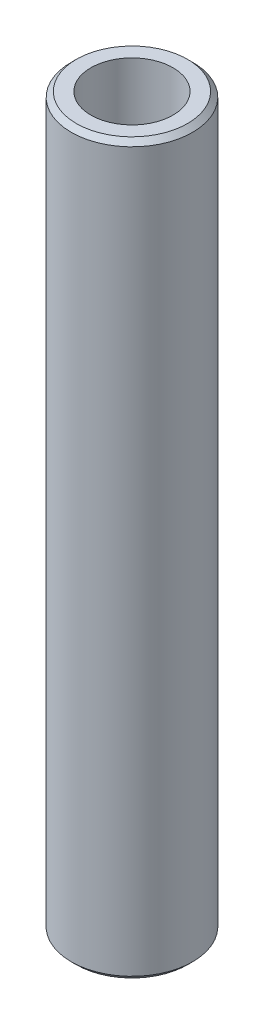
ISO-10303-21;
HEADER;
FILE_DESCRIPTION(('STEP AP214'),'2;1');
FILE_NAME('part.step','',(''),(''),'','','');
FILE_SCHEMA(('AUTOMOTIVE_DESIGN { 1 0 10303 214 1 1 1 1 }'));
ENDSEC;
DATA;
#1=APPLICATION_CONTEXT('core data for automotive mechanical design processes');
#2=APPLICATION_PROTOCOL_DEFINITION('international standard','automotive_design',2000,#1);
#3=PRODUCT_CONTEXT('',#1,'mechanical');
#4=PRODUCT('Part','Part','',(#3));
#5=PRODUCT_RELATED_PRODUCT_CATEGORY('part','',(#4));
#6=PRODUCT_DEFINITION_FORMATION('','',#4);
#7=PRODUCT_DEFINITION_CONTEXT('part definition',#1,'design');
#8=PRODUCT_DEFINITION('design','',#6,#7);
#9=PRODUCT_DEFINITION_SHAPE('','',#8);
#10=(LENGTH_UNIT() NAMED_UNIT(*) SI_UNIT(.MILLI.,.METRE.));
#11=(NAMED_UNIT(*) PLANE_ANGLE_UNIT() SI_UNIT($,.RADIAN.));
#12=(NAMED_UNIT(*) SI_UNIT($,.STERADIAN.) SOLID_ANGLE_UNIT());
#13=UNCERTAINTY_MEASURE_WITH_UNIT(LENGTH_MEASURE(1.E-05),#10,'distance_accuracy_value','');
#14=(GEOMETRIC_REPRESENTATION_CONTEXT(3) GLOBAL_UNCERTAINTY_ASSIGNED_CONTEXT((#13)) GLOBAL_UNIT_ASSIGNED_CONTEXT((#10,
#11,#12)) REPRESENTATION_CONTEXT('',''));
#15=CARTESIAN_POINT('',(0.,0.,0.));
#16=DIRECTION('',(0.,0.,1.));
#17=DIRECTION('',(1.,0.,0.));
#18=AXIS2_PLACEMENT_3D('',#15,#16,#17);
#19=CARTESIAN_POINT('',(0.,600.,0.));
#20=DIRECTION('',(0.,-1.,0.));
#21=DIRECTION('',(0.,0.,-1.));
#22=AXIS2_PLACEMENT_3D('',#19,#20,#21);
#23=CYLINDRICAL_SURFACE('',#22,50.);
#24=CARTESIAN_POINT('',(0.,595.824829830762,0.));
#25=DIRECTION('',(0.,1.,0.));
#26=DIRECTION('',(0.,0.,1.));
#27=AXIS2_PLACEMENT_3D('',#24,#25,#26);
#28=CIRCLE('',#27,50.);
#29=CARTESIAN_POINT('',(0.,595.824829830762,50.));
#30=VERTEX_POINT('',#29);
#31=EDGE_CURVE('E50',#30,#30,#28,.F.);
#32=ORIENTED_EDGE('',*,*,#31,.T.);
#33=EDGE_LOOP('',(#32));
#34=FACE_BOUND('',#33,.T.);
#35=CARTESIAN_POINT('',(0.,4.17517016923774,0.));
#36=DIRECTION('',(0.,1.,0.));
#37=DIRECTION('',(0.,0.,1.));
#38=AXIS2_PLACEMENT_3D('',#35,#36,#37);
#39=CIRCLE('',#38,50.);
#40=CARTESIAN_POINT('',(0.,4.17517016923774,50.));
#41=VERTEX_POINT('',#40);
#42=EDGE_CURVE('E51',#41,#41,#39,.T.);
#43=ORIENTED_EDGE('',*,*,#42,.T.);
#44=EDGE_LOOP('',(#43));
#45=FACE_BOUND('',#44,.T.);
#46=ADVANCED_FACE('F39',(#34,#45),#23,.T.);
#47=CARTESIAN_POINT('',(0.,600.,0.));
#48=DIRECTION('',(0.,1.,0.));
#49=DIRECTION('',(0.,0.,1.));
#50=AXIS2_PLACEMENT_3D('',#47,#48,#49);
#51=PLANE('',#50);
#52=CARTESIAN_POINT('',(0.,600.,0.));
#53=DIRECTION('',(0.,1.,0.));
#54=DIRECTION('',(0.,0.,1.));
#55=AXIS2_PLACEMENT_3D('',#52,#53,#54);
#56=CIRCLE('',#55,45.824829830762);
#57=CARTESIAN_POINT('',(0.,600.,45.824829830762));
#58=VERTEX_POINT('',#57);
#59=EDGE_CURVE('E54',#58,#58,#56,.T.);
#60=ORIENTED_EDGE('',*,*,#59,.T.);
#61=EDGE_LOOP('',(#60));
#62=FACE_BOUND('',#61,.T.);
#63=CARTESIAN_POINT('',(0.,600.,0.));
#64=DIRECTION('',(0.,1.,0.));
#65=DIRECTION('',(0.,0.,1.));
#66=AXIS2_PLACEMENT_3D('',#63,#64,#65);
#67=CIRCLE('',#66,33.8407079080339);
#68=CARTESIAN_POINT('',(0.,600.,33.8407079080339));
#69=VERTEX_POINT('',#68);
#70=EDGE_CURVE('E58',#69,#69,#67,.T.);
#71=ORIENTED_EDGE('',*,*,#70,.F.);
#72=EDGE_LOOP('',(#71));
#73=FACE_BOUND('',#72,.T.);
#74=ADVANCED_FACE('F69',(#62,#73),#51,.T.);
#75=CARTESIAN_POINT('',(0.,0.,0.));
#76=DIRECTION('',(0.,1.,0.));
#77=DIRECTION('',(0.,0.,1.));
#78=AXIS2_PLACEMENT_3D('',#75,#76,#77);
#79=PLANE('',#78);
#80=CARTESIAN_POINT('',(0.,0.,0.));
#81=DIRECTION('',(0.,1.,0.));
#82=DIRECTION('',(0.,0.,1.));
#83=AXIS2_PLACEMENT_3D('',#80,#81,#82);
#84=CIRCLE('',#83,45.8248298307621);
#85=CARTESIAN_POINT('',(0.,0.,45.8248298307621));
#86=VERTEX_POINT('',#85);
#87=EDGE_CURVE('E10',#86,#86,#84,.F.);
#88=ORIENTED_EDGE('',*,*,#87,.T.);
#89=EDGE_LOOP('',(#88));
#90=FACE_BOUND('',#89,.T.);
#91=CARTESIAN_POINT('',(0.,0.,0.));
#92=DIRECTION('',(0.,1.,0.));
#93=DIRECTION('',(0.,0.,1.));
#94=AXIS2_PLACEMENT_3D('',#91,#92,#93);
#95=CIRCLE('',#94,33.8407079080339);
#96=CARTESIAN_POINT('',(0.,0.,33.8407079080339));
#97=VERTEX_POINT('',#96);
#98=EDGE_CURVE('E63',#97,#97,#95,.T.);
#99=ORIENTED_EDGE('',*,*,#98,.T.);
#100=EDGE_LOOP('',(#99));
#101=FACE_BOUND('',#100,.T.);
#102=ADVANCED_FACE('F75',(#90,#101),#79,.F.);
#103=CARTESIAN_POINT('',(0.,600.,0.));
#104=DIRECTION('',(0.,-1.,0.));
#105=DIRECTION('',(0.,0.,-1.));
#106=AXIS2_PLACEMENT_3D('',#103,#104,#105);
#107=CYLINDRICAL_SURFACE('',#106,33.8407079080339);
#108=ORIENTED_EDGE('',*,*,#70,.T.);
#109=EDGE_LOOP('',(#108));
#110=FACE_BOUND('',#109,.T.);
#111=ORIENTED_EDGE('',*,*,#98,.F.);
#112=EDGE_LOOP('',(#111));
#113=FACE_BOUND('',#112,.T.);
#114=ADVANCED_FACE('F70',(#110,#113),#107,.F.);
#115=CARTESIAN_POINT('',(0.,600.,0.));
#116=DIRECTION('',(0.,-1.,0.));
#117=DIRECTION('',(0.,0.,-1.));
#118=AXIS2_PLACEMENT_3D('',#115,#116,#117);
#119=CONICAL_SURFACE('',#118,45.824829830762,0.785398163397437);
#120=ORIENTED_EDGE('',*,*,#31,.F.);
#121=EDGE_LOOP('',(#120));
#122=FACE_BOUND('',#121,.T.);
#123=ORIENTED_EDGE('',*,*,#59,.F.);
#124=EDGE_LOOP('',(#123));
#125=FACE_BOUND('',#124,.T.);
#126=ADVANCED_FACE('F81',(#122,#125),#119,.T.);
#127=CARTESIAN_POINT('',(0.,4.17517016923774,0.));
#128=DIRECTION('',(0.,1.,0.));
#129=DIRECTION('',(0.,0.,1.));
#130=AXIS2_PLACEMENT_3D('',#127,#128,#129);
#131=CONICAL_SURFACE('',#130,50.,0.785398163397462);
#132=ORIENTED_EDGE('',*,*,#87,.F.);
#133=EDGE_LOOP('',(#132));
#134=FACE_BOUND('',#133,.T.);
#135=ORIENTED_EDGE('',*,*,#42,.F.);
#136=EDGE_LOOP('',(#135));
#137=FACE_BOUND('',#136,.T.);
#138=ADVANCED_FACE('F45',(#134,#137),#131,.T.);
#139=CLOSED_SHELL('',(#46,#74,#102,#114,#126,#138));
#140=MANIFOLD_SOLID_BREP('B2',#139);
#141=ADVANCED_BREP_SHAPE_REPRESENTATION('',(#18,#140),#14);
#142=SHAPE_DEFINITION_REPRESENTATION(#9,#141);
ENDSEC;
END-ISO-10303-21;
